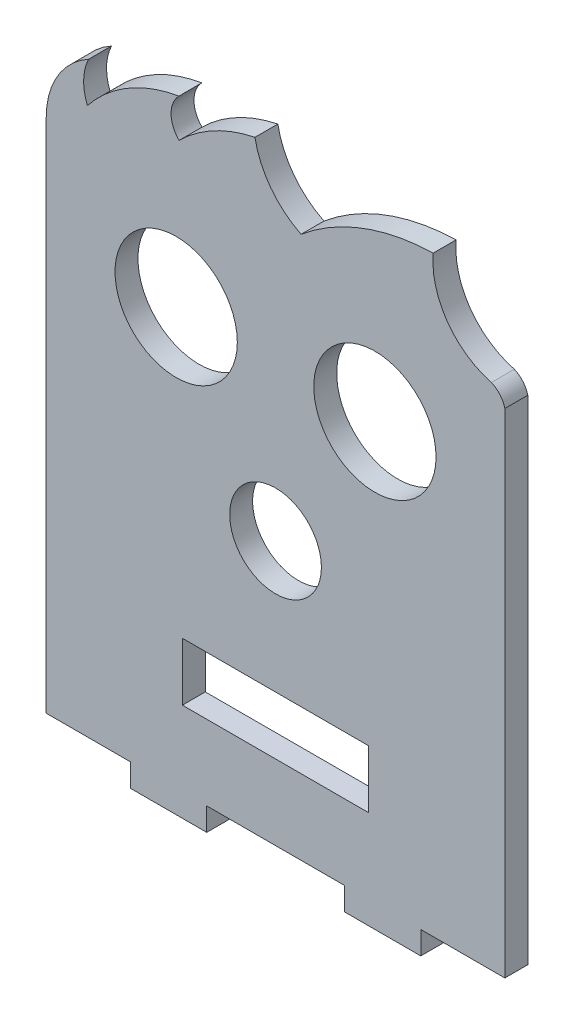
ISO-10303-21;
HEADER;
FILE_DESCRIPTION(('STEP AP214'),'2;1');
FILE_NAME('part.step','',(''),(''),'','','');
FILE_SCHEMA(('AUTOMOTIVE_DESIGN { 1 0 10303 214 1 1 1 1 }'));
ENDSEC;
DATA;
#1=APPLICATION_CONTEXT('core data for automotive mechanical design processes');
#2=APPLICATION_PROTOCOL_DEFINITION('international standard','automotive_design',2000,#1);
#3=PRODUCT_CONTEXT('',#1,'mechanical');
#4=PRODUCT('Part','Part','',(#3));
#5=PRODUCT_RELATED_PRODUCT_CATEGORY('part','',(#4));
#6=PRODUCT_DEFINITION_FORMATION('','',#4);
#7=PRODUCT_DEFINITION_CONTEXT('part definition',#1,'design');
#8=PRODUCT_DEFINITION('design','',#6,#7);
#9=PRODUCT_DEFINITION_SHAPE('','',#8);
#10=(LENGTH_UNIT() NAMED_UNIT(*) SI_UNIT(.MILLI.,.METRE.));
#11=(NAMED_UNIT(*) PLANE_ANGLE_UNIT() SI_UNIT($,.RADIAN.));
#12=(NAMED_UNIT(*) SI_UNIT($,.STERADIAN.) SOLID_ANGLE_UNIT());
#13=UNCERTAINTY_MEASURE_WITH_UNIT(LENGTH_MEASURE(1.E-05),#10,'distance_accuracy_value','');
#14=(GEOMETRIC_REPRESENTATION_CONTEXT(3) GLOBAL_UNCERTAINTY_ASSIGNED_CONTEXT((#13)) GLOBAL_UNIT_ASSIGNED_CONTEXT((#10,
#11,#12)) REPRESENTATION_CONTEXT('',''));
#15=CARTESIAN_POINT('',(0.,0.,0.));
#16=DIRECTION('',(0.,0.,1.));
#17=DIRECTION('',(1.,0.,0.));
#18=AXIS2_PLACEMENT_3D('',#15,#16,#17);
#19=CARTESIAN_POINT('',(57.0828060122341,63.8250898911995,3.));
#20=DIRECTION('',(0.,0.,1.));
#21=DIRECTION('',(1.,0.,0.));
#22=AXIS2_PLACEMENT_3D('',#19,#20,#21);
#23=PLANE('',#22);
#24=CARTESIAN_POINT('',(17.,54.5250750608487,3.));
#25=DIRECTION('',(0.,0.,1.));
#26=DIRECTION('',(1.,0.,0.));
#27=AXIS2_PLACEMENT_3D('',#24,#25,#26);
#28=CIRCLE('',#27,8.);
#29=CARTESIAN_POINT('',(25.,54.5250750608487,3.));
#30=VERTEX_POINT('',#29);
#31=EDGE_CURVE('E236',#30,#30,#28,.T.);
#32=ORIENTED_EDGE('',*,*,#31,.F.);
#33=EDGE_LOOP('',(#32));
#34=FACE_BOUND('',#33,.T.);
#35=CARTESIAN_POINT('',(57.0828060122341,63.8250898911995,3.));
#36=DIRECTION('',(0.,0.,1.));
#37=DIRECTION('',(1.,0.,0.));
#38=AXIS2_PLACEMENT_3D('',#35,#36,#37);
#39=CIRCLE('',#38,2.99999999995479);
#40=CARTESIAN_POINT('',(59.9999999999508,64.5250750608696,3.));
#41=VERTEX_POINT('',#40);
#42=CARTESIAN_POINT('',(58.2415675698039,66.5922674518969,3.));
#43=VERTEX_POINT('',#42);
#44=EDGE_CURVE('E248',#41,#43,#39,.T.);
#45=ORIENTED_EDGE('',*,*,#44,.T.);
#46=CARTESIAN_POINT('',(60.892074174128,76.5534327823503,3.));
#47=DIRECTION('',(0.,0.,-1.));
#48=DIRECTION('',(1.,0.,0.));
#49=AXIS2_PLACEMENT_3D('',#46,#47,#48);
#50=CIRCLE('',#49,10.3077640640535);
#51=CARTESIAN_POINT('',(50.622765109335,77.4429783584468,3.));
#52=VERTEX_POINT('',#51);
#53=EDGE_CURVE('E251',#43,#52,#50,.T.);
#54=ORIENTED_EDGE('',*,*,#53,.T.);
#55=CARTESIAN_POINT('',(51.2729090936527,49.5195795378246,3.));
#56=DIRECTION('',(0.,0.,1.));
#57=DIRECTION('',(1.,0.,0.));
#58=AXIS2_PLACEMENT_3D('',#55,#56,#57);
#59=CIRCLE('',#58,27.9309664869634);
#60=CARTESIAN_POINT('',(33.342205194527,70.9351987578646,3.));
#61=VERTEX_POINT('',#60);
#62=EDGE_CURVE('E254',#52,#61,#59,.T.);
#63=ORIENTED_EDGE('',*,*,#62,.T.);
#64=CARTESIAN_POINT('',(38.2960443073955,80.9581463304664,3.));
#65=DIRECTION('',(0.,0.,-1.));
#66=DIRECTION('',(1.,0.,0.));
#67=AXIS2_PLACEMENT_3D('',#64,#65,#66);
#68=CIRCLE('',#67,11.1803398874681);
#69=CARTESIAN_POINT('',(27.305382781595,78.907449077189,3.));
#70=VERTEX_POINT('',#69);
#71=EDGE_CURVE('E256',#61,#70,#68,.T.);
#72=ORIENTED_EDGE('',*,*,#71,.T.);
#73=CARTESIAN_POINT('',(31.2979275877632,59.5128255254766,3.));
#74=DIRECTION('',(0.,0.,1.));
#75=DIRECTION('',(1.,0.,0.));
#76=AXIS2_PLACEMENT_3D('',#73,#74,#75);
#77=CIRCLE('',#76,19.8013089653663);
#78=CARTESIAN_POINT('',(17.379828576101,73.5975107063199,3.));
#79=VERTEX_POINT('',#78);
#80=EDGE_CURVE('E258',#70,#79,#77,.T.);
#81=ORIENTED_EDGE('',*,*,#80,.T.);
#82=CARTESIAN_POINT('',(19.8682750672394,76.1090110668844,3.));
#83=DIRECTION('',(0.,0.,-1.));
#84=DIRECTION('',(1.,0.,0.));
#85=AXIS2_PLACEMENT_3D('',#82,#83,#84);
#86=CIRCLE('',#85,3.53553390598575);
#87=CARTESIAN_POINT('',(17.356774706675,78.5974575580229,3.));
#88=VERTEX_POINT('',#87);
#89=EDGE_CURVE('E260',#79,#88,#86,.T.);
#90=ORIENTED_EDGE('',*,*,#89,.T.);
#91=CARTESIAN_POINT('',(20.5448075358998,59.5119539838493,3.));
#92=DIRECTION('',(0.,0.,1.));
#93=DIRECTION('',(1.,0.,0.));
#94=AXIS2_PLACEMENT_3D('',#91,#92,#93);
#95=CIRCLE('',#94,19.3499354004093);
#96=CARTESIAN_POINT('',(5.38917767995182,71.5422026790969,3.));
#97=VERTEX_POINT('',#96);
#98=EDGE_CURVE('E262',#88,#97,#95,.T.);
#99=ORIENTED_EDGE('',*,*,#98,.T.);
#100=CARTESIAN_POINT('',(11.4111939225212,74.0392650279305,3.));
#101=DIRECTION('',(0.,0.,-1.));
#102=DIRECTION('',(1.,0.,0.));
#103=AXIS2_PLACEMENT_3D('',#100,#101,#102);
#104=CIRCLE('',#103,6.51920240518206);
#105=CARTESIAN_POINT('',(5.53620196702089,76.8649453924689,3.));
#106=VERTEX_POINT('',#105);
#107=EDGE_CURVE('E264',#97,#106,#104,.T.);
#108=ORIENTED_EDGE('',*,*,#107,.T.);
#109=CARTESIAN_POINT('',(10.6447043172942,67.5261588056378,3.));
#110=DIRECTION('',(0.,0.,1.));
#111=DIRECTION('',(1.,0.,0.));
#112=AXIS2_PLACEMENT_3D('',#109,#110,#111);
#113=CIRCLE('',#112,10.6447043724626);
#114=CARTESIAN_POINT('',(0.,67.5250750608487,3.));
#115=VERTEX_POINT('',#114);
#116=EDGE_CURVE('E266',#106,#115,#113,.T.);
#117=ORIENTED_EDGE('',*,*,#116,.T.);
#118=DIRECTION('',(0.,-1.,0.));
#119=VECTOR('',#118,1.);
#120=CARTESIAN_POINT('',(0.,67.5250750608487,3.));
#121=LINE('',#120,#119);
#122=CARTESIAN_POINT('',(0.,0.,3.));
#123=VERTEX_POINT('',#122);
#124=EDGE_CURVE('E268',#115,#123,#121,.T.);
#125=ORIENTED_EDGE('',*,*,#124,.T.);
#126=DIRECTION('',(1.,0.,0.));
#127=VECTOR('',#126,1.);
#128=CARTESIAN_POINT('',(0.,0.,3.));
#129=LINE('',#128,#127);
#130=CARTESIAN_POINT('',(11.,0.,3.));
#131=VERTEX_POINT('',#130);
#132=EDGE_CURVE('E270',#123,#131,#129,.T.);
#133=ORIENTED_EDGE('',*,*,#132,.T.);
#134=DIRECTION('',(0.,-1.,0.));
#135=VECTOR('',#134,1.);
#136=CARTESIAN_POINT('',(11.,0.,3.));
#137=LINE('',#136,#135);
#138=CARTESIAN_POINT('',(11.,-3.,3.));
#139=VERTEX_POINT('',#138);
#140=EDGE_CURVE('E272',#131,#139,#137,.T.);
#141=ORIENTED_EDGE('',*,*,#140,.T.);
#142=DIRECTION('',(1.,0.,0.));
#143=VECTOR('',#142,1.);
#144=CARTESIAN_POINT('',(11.,-3.,3.));
#145=LINE('',#144,#143);
#146=CARTESIAN_POINT('',(21.,-3.,3.));
#147=VERTEX_POINT('',#146);
#148=EDGE_CURVE('E274',#139,#147,#145,.T.);
#149=ORIENTED_EDGE('',*,*,#148,.T.);
#150=DIRECTION('',(0.,1.,0.));
#151=VECTOR('',#150,1.);
#152=CARTESIAN_POINT('',(21.,-3.,3.));
#153=LINE('',#152,#151);
#154=CARTESIAN_POINT('',(21.,0.,3.));
#155=VERTEX_POINT('',#154);
#156=EDGE_CURVE('E276',#147,#155,#153,.T.);
#157=ORIENTED_EDGE('',*,*,#156,.T.);
#158=DIRECTION('',(1.,0.,0.));
#159=VECTOR('',#158,1.);
#160=CARTESIAN_POINT('',(21.,0.,3.));
#161=LINE('',#160,#159);
#162=CARTESIAN_POINT('',(39.,0.,3.));
#163=VERTEX_POINT('',#162);
#164=EDGE_CURVE('E278',#155,#163,#161,.T.);
#165=ORIENTED_EDGE('',*,*,#164,.T.);
#166=DIRECTION('',(0.,-1.,0.));
#167=VECTOR('',#166,1.);
#168=CARTESIAN_POINT('',(39.,0.,3.));
#169=LINE('',#168,#167);
#170=CARTESIAN_POINT('',(39.,-3.,3.));
#171=VERTEX_POINT('',#170);
#172=EDGE_CURVE('E280',#163,#171,#169,.T.);
#173=ORIENTED_EDGE('',*,*,#172,.T.);
#174=DIRECTION('',(1.,0.,0.));
#175=VECTOR('',#174,1.);
#176=CARTESIAN_POINT('',(49.,-2.99999999999999,3.));
#177=LINE('',#176,#175);
#178=CARTESIAN_POINT('',(49.,-2.99999999999999,3.));
#179=VERTEX_POINT('',#178);
#180=EDGE_CURVE('E282',#171,#179,#177,.T.);
#181=ORIENTED_EDGE('',*,*,#180,.T.);
#182=DIRECTION('',(0.,1.,0.));
#183=VECTOR('',#182,1.);
#184=CARTESIAN_POINT('',(49.,-2.99999999999999,3.));
#185=LINE('',#184,#183);
#186=CARTESIAN_POINT('',(49.,0.,3.));
#187=VERTEX_POINT('',#186);
#188=EDGE_CURVE('E284',#179,#187,#185,.T.);
#189=ORIENTED_EDGE('',*,*,#188,.T.);
#190=DIRECTION('',(1.,0.,0.));
#191=VECTOR('',#190,1.);
#192=CARTESIAN_POINT('',(49.,0.,3.));
#193=LINE('',#192,#191);
#194=CARTESIAN_POINT('',(60.,0.,3.));
#195=VERTEX_POINT('',#194);
#196=EDGE_CURVE('E286',#187,#195,#193,.T.);
#197=ORIENTED_EDGE('',*,*,#196,.T.);
#198=DIRECTION('',(-7.61583718904839E-13,1.,0.));
#199=VECTOR('',#198,1.);
#200=CARTESIAN_POINT('',(60.,0.,3.));
#201=LINE('',#200,#199);
#202=EDGE_CURVE('E288',#195,#41,#201,.T.);
#203=ORIENTED_EDGE('',*,*,#202,.T.);
#204=EDGE_LOOP('',(#45,#54,#63,#72,#81,#90,#99,#108,#117,#125,#133,#141,#149,#157,#165,#173,
#181,#189,#197,#203));
#205=FACE_BOUND('',#204,.T.);
#206=CARTESIAN_POINT('',(43.,54.5250750608487,3.));
#207=DIRECTION('',(0.,0.,1.));
#208=DIRECTION('',(1.,0.,0.));
#209=AXIS2_PLACEMENT_3D('',#206,#207,#208);
#210=CIRCLE('',#209,8.);
#211=CARTESIAN_POINT('',(51.,54.5250750608487,3.));
#212=VERTEX_POINT('',#211);
#213=EDGE_CURVE('E242',#212,#212,#210,.T.);
#214=ORIENTED_EDGE('',*,*,#213,.F.);
#215=EDGE_LOOP('',(#214));
#216=FACE_BOUND('',#215,.T.);
#217=CARTESIAN_POINT('',(30.,34.5250750608487,3.));
#218=DIRECTION('',(0.,0.,1.));
#219=DIRECTION('',(1.,0.,0.));
#220=AXIS2_PLACEMENT_3D('',#217,#218,#219);
#221=CIRCLE('',#220,6.00000000000001);
#222=CARTESIAN_POINT('',(36.,34.5250750608487,3.));
#223=VERTEX_POINT('',#222);
#224=EDGE_CURVE('E230',#223,#223,#221,.T.);
#225=ORIENTED_EDGE('',*,*,#224,.F.);
#226=EDGE_LOOP('',(#225));
#227=FACE_BOUND('',#226,.T.);
#228=DIRECTION('',(0.,-1.,0.));
#229=VECTOR('',#228,1.);
#230=CARTESIAN_POINT('',(17.8099999999999,17.3990809937483,3.));
#231=LINE('',#230,#229);
#232=CARTESIAN_POINT('',(17.8099999999999,17.3990809937483,3.));
#233=VERTEX_POINT('',#232);
#234=CARTESIAN_POINT('',(17.8099999999999,9.81908099374828,3.));
#235=VERTEX_POINT('',#234);
#236=EDGE_CURVE('E202',#233,#235,#231,.T.);
#237=ORIENTED_EDGE('',*,*,#236,.F.);
#238=DIRECTION('',(-1.,0.,0.));
#239=VECTOR('',#238,1.);
#240=CARTESIAN_POINT('',(42.1899999999999,17.3990809937483,3.));
#241=LINE('',#240,#239);
#242=CARTESIAN_POINT('',(42.1899999999999,17.3990809937483,3.));
#243=VERTEX_POINT('',#242);
#244=EDGE_CURVE('E194',#243,#233,#241,.T.);
#245=ORIENTED_EDGE('',*,*,#244,.F.);
#246=DIRECTION('',(0.,1.,0.));
#247=VECTOR('',#246,1.);
#248=CARTESIAN_POINT('',(42.1899999999999,9.81908099374828,3.));
#249=LINE('',#248,#247);
#250=CARTESIAN_POINT('',(42.1899999999999,9.81908099374828,3.));
#251=VERTEX_POINT('',#250);
#252=EDGE_CURVE('E216',#251,#243,#249,.T.);
#253=ORIENTED_EDGE('',*,*,#252,.F.);
#254=DIRECTION('',(1.,0.,0.));
#255=VECTOR('',#254,1.);
#256=CARTESIAN_POINT('',(17.8099999999999,9.81908099374828,3.));
#257=LINE('',#256,#255);
#258=EDGE_CURVE('E214',#235,#251,#257,.T.);
#259=ORIENTED_EDGE('',*,*,#258,.F.);
#260=EDGE_LOOP('',(#237,#245,#253,#259));
#261=FACE_BOUND('',#260,.T.);
#262=ADVANCED_FACE('F33',(#34,#205,#216,#227,#261),#23,.T.);
#263=CARTESIAN_POINT('',(57.0828060122341,63.8250898911995,0.));
#264=DIRECTION('',(0.,0.,1.));
#265=DIRECTION('',(1.,0.,0.));
#266=AXIS2_PLACEMENT_3D('',#263,#264,#265);
#267=PLANE('',#266);
#268=CARTESIAN_POINT('',(30.,34.5250750608487,0.));
#269=DIRECTION('',(0.,0.,1.));
#270=DIRECTION('',(1.,0.,0.));
#271=AXIS2_PLACEMENT_3D('',#268,#269,#270);
#272=CIRCLE('',#271,6.00000000000001);
#273=CARTESIAN_POINT('',(36.,34.5250750608487,0.));
#274=VERTEX_POINT('',#273);
#275=EDGE_CURVE('E210',#274,#274,#272,.T.);
#276=ORIENTED_EDGE('',*,*,#275,.T.);
#277=EDGE_LOOP('',(#276));
#278=FACE_BOUND('',#277,.T.);
#279=CARTESIAN_POINT('',(17.,54.5250750608487,0.));
#280=DIRECTION('',(0.,0.,1.));
#281=DIRECTION('',(1.,0.,0.));
#282=AXIS2_PLACEMENT_3D('',#279,#280,#281);
#283=CIRCLE('',#282,8.);
#284=CARTESIAN_POINT('',(25.,54.5250750608487,0.));
#285=VERTEX_POINT('',#284);
#286=EDGE_CURVE('E233',#285,#285,#283,.T.);
#287=ORIENTED_EDGE('',*,*,#286,.T.);
#288=EDGE_LOOP('',(#287));
#289=FACE_BOUND('',#288,.T.);
#290=CARTESIAN_POINT('',(43.,54.5250750608487,0.));
#291=DIRECTION('',(0.,0.,1.));
#292=DIRECTION('',(1.,0.,0.));
#293=AXIS2_PLACEMENT_3D('',#290,#291,#292);
#294=CIRCLE('',#293,8.);
#295=CARTESIAN_POINT('',(51.,54.5250750608487,0.));
#296=VERTEX_POINT('',#295);
#297=EDGE_CURVE('E239',#296,#296,#294,.T.);
#298=ORIENTED_EDGE('',*,*,#297,.T.);
#299=EDGE_LOOP('',(#298));
#300=FACE_BOUND('',#299,.T.);
#301=CARTESIAN_POINT('',(57.0828060122341,63.8250898911995,0.));
#302=DIRECTION('',(0.,0.,1.));
#303=DIRECTION('',(1.,0.,0.));
#304=AXIS2_PLACEMENT_3D('',#301,#302,#303);
#305=CIRCLE('',#304,2.99999999995479);
#306=CARTESIAN_POINT('',(59.9999999999508,64.5250750608696,0.));
#307=VERTEX_POINT('',#306);
#308=CARTESIAN_POINT('',(58.2415675698039,66.5922674518969,0.));
#309=VERTEX_POINT('',#308);
#310=EDGE_CURVE('E245',#307,#309,#305,.T.);
#311=ORIENTED_EDGE('',*,*,#310,.F.);
#312=DIRECTION('',(-7.61583718904839E-13,1.,0.));
#313=VECTOR('',#312,1.);
#314=CARTESIAN_POINT('',(60.,0.,0.));
#315=LINE('',#314,#313);
#316=CARTESIAN_POINT('',(60.,0.,0.));
#317=VERTEX_POINT('',#316);
#318=EDGE_CURVE('E252',#317,#307,#315,.T.);
#319=ORIENTED_EDGE('',*,*,#318,.F.);
#320=DIRECTION('',(1.,0.,0.));
#321=VECTOR('',#320,1.);
#322=CARTESIAN_POINT('',(49.,0.,0.));
#323=LINE('',#322,#321);
#324=CARTESIAN_POINT('',(49.,0.,0.));
#325=VERTEX_POINT('',#324);
#326=EDGE_CURVE('E328',#325,#317,#323,.T.);
#327=ORIENTED_EDGE('',*,*,#326,.F.);
#328=DIRECTION('',(0.,1.,0.));
#329=VECTOR('',#328,1.);
#330=CARTESIAN_POINT('',(49.,-2.99999999999999,0.));
#331=LINE('',#330,#329);
#332=CARTESIAN_POINT('',(49.,-2.99999999999999,0.));
#333=VERTEX_POINT('',#332);
#334=EDGE_CURVE('E326',#333,#325,#331,.T.);
#335=ORIENTED_EDGE('',*,*,#334,.F.);
#336=DIRECTION('',(1.,0.,0.));
#337=VECTOR('',#336,1.);
#338=CARTESIAN_POINT('',(49.,-2.99999999999999,0.));
#339=LINE('',#338,#337);
#340=CARTESIAN_POINT('',(39.,-3.,0.));
#341=VERTEX_POINT('',#340);
#342=EDGE_CURVE('E324',#341,#333,#339,.T.);
#343=ORIENTED_EDGE('',*,*,#342,.F.);
#344=DIRECTION('',(0.,-1.,0.));
#345=VECTOR('',#344,1.);
#346=CARTESIAN_POINT('',(39.,0.,0.));
#347=LINE('',#346,#345);
#348=CARTESIAN_POINT('',(39.,0.,0.));
#349=VERTEX_POINT('',#348);
#350=EDGE_CURVE('E322',#349,#341,#347,.T.);
#351=ORIENTED_EDGE('',*,*,#350,.F.);
#352=DIRECTION('',(1.,0.,0.));
#353=VECTOR('',#352,1.);
#354=CARTESIAN_POINT('',(21.,0.,0.));
#355=LINE('',#354,#353);
#356=CARTESIAN_POINT('',(21.,0.,0.));
#357=VERTEX_POINT('',#356);
#358=EDGE_CURVE('E320',#357,#349,#355,.T.);
#359=ORIENTED_EDGE('',*,*,#358,.F.);
#360=DIRECTION('',(0.,1.,0.));
#361=VECTOR('',#360,1.);
#362=CARTESIAN_POINT('',(21.,-3.,0.));
#363=LINE('',#362,#361);
#364=CARTESIAN_POINT('',(21.,-3.,0.));
#365=VERTEX_POINT('',#364);
#366=EDGE_CURVE('E318',#365,#357,#363,.T.);
#367=ORIENTED_EDGE('',*,*,#366,.F.);
#368=DIRECTION('',(1.,0.,0.));
#369=VECTOR('',#368,1.);
#370=CARTESIAN_POINT('',(11.,-3.,0.));
#371=LINE('',#370,#369);
#372=CARTESIAN_POINT('',(11.,-3.,0.));
#373=VERTEX_POINT('',#372);
#374=EDGE_CURVE('E316',#373,#365,#371,.T.);
#375=ORIENTED_EDGE('',*,*,#374,.F.);
#376=DIRECTION('',(0.,-1.,0.));
#377=VECTOR('',#376,1.);
#378=CARTESIAN_POINT('',(11.,0.,0.));
#379=LINE('',#378,#377);
#380=CARTESIAN_POINT('',(11.,0.,0.));
#381=VERTEX_POINT('',#380);
#382=EDGE_CURVE('E314',#381,#373,#379,.T.);
#383=ORIENTED_EDGE('',*,*,#382,.F.);
#384=DIRECTION('',(1.,0.,0.));
#385=VECTOR('',#384,1.);
#386=CARTESIAN_POINT('',(0.,0.,0.));
#387=LINE('',#386,#385);
#388=CARTESIAN_POINT('',(0.,0.,0.));
#389=VERTEX_POINT('',#388);
#390=EDGE_CURVE('E312',#389,#381,#387,.T.);
#391=ORIENTED_EDGE('',*,*,#390,.F.);
#392=DIRECTION('',(0.,-1.,0.));
#393=VECTOR('',#392,1.);
#394=CARTESIAN_POINT('',(0.,11.5200977794683,0.));
#395=LINE('',#394,#393);
#396=CARTESIAN_POINT('',(0.,67.5250750608487,0.));
#397=VERTEX_POINT('',#396);
#398=EDGE_CURVE('E310',#397,#389,#395,.T.);
#399=ORIENTED_EDGE('',*,*,#398,.F.);
#400=CARTESIAN_POINT('',(10.6447043172942,67.5261588056378,0.));
#401=DIRECTION('',(0.,0.,1.));
#402=DIRECTION('',(1.,0.,0.));
#403=AXIS2_PLACEMENT_3D('',#400,#401,#402);
#404=CIRCLE('',#403,10.6447043724626);
#405=CARTESIAN_POINT('',(5.53620196702089,76.8649453924689,0.));
#406=VERTEX_POINT('',#405);
#407=EDGE_CURVE('E307',#406,#397,#404,.T.);
#408=ORIENTED_EDGE('',*,*,#407,.F.);
#409=CARTESIAN_POINT('',(11.4111939225212,74.0392650279305,0.));
#410=DIRECTION('',(0.,0.,-1.));
#411=DIRECTION('',(1.,0.,0.));
#412=AXIS2_PLACEMENT_3D('',#409,#410,#411);
#413=CIRCLE('',#412,6.51920240518206);
#414=CARTESIAN_POINT('',(5.38917767995182,71.5422026790969,0.));
#415=VERTEX_POINT('',#414);
#416=EDGE_CURVE('E305',#415,#406,#413,.T.);
#417=ORIENTED_EDGE('',*,*,#416,.F.);
#418=CARTESIAN_POINT('',(20.5448075358998,59.5119539838493,0.));
#419=DIRECTION('',(0.,0.,1.));
#420=DIRECTION('',(1.,0.,0.));
#421=AXIS2_PLACEMENT_3D('',#418,#419,#420);
#422=CIRCLE('',#421,19.3499354004093);
#423=CARTESIAN_POINT('',(17.356774706675,78.5974575580229,0.));
#424=VERTEX_POINT('',#423);
#425=EDGE_CURVE('E303',#424,#415,#422,.T.);
#426=ORIENTED_EDGE('',*,*,#425,.F.);
#427=CARTESIAN_POINT('',(19.8682750672394,76.1090110668844,0.));
#428=DIRECTION('',(0.,0.,-1.));
#429=DIRECTION('',(1.,0.,0.));
#430=AXIS2_PLACEMENT_3D('',#427,#428,#429);
#431=CIRCLE('',#430,3.53553390598575);
#432=CARTESIAN_POINT('',(17.379828576101,73.5975107063199,0.));
#433=VERTEX_POINT('',#432);
#434=EDGE_CURVE('E301',#433,#424,#431,.T.);
#435=ORIENTED_EDGE('',*,*,#434,.F.);
#436=CARTESIAN_POINT('',(31.2979275877632,59.5128255254766,0.));
#437=DIRECTION('',(0.,0.,1.));
#438=DIRECTION('',(1.,0.,0.));
#439=AXIS2_PLACEMENT_3D('',#436,#437,#438);
#440=CIRCLE('',#439,19.8013089653663);
#441=CARTESIAN_POINT('',(27.305382781595,78.907449077189,0.));
#442=VERTEX_POINT('',#441);
#443=EDGE_CURVE('E299',#442,#433,#440,.T.);
#444=ORIENTED_EDGE('',*,*,#443,.F.);
#445=CARTESIAN_POINT('',(38.2960443073955,80.9581463304664,0.));
#446=DIRECTION('',(0.,0.,-1.));
#447=DIRECTION('',(1.,0.,0.));
#448=AXIS2_PLACEMENT_3D('',#445,#446,#447);
#449=CIRCLE('',#448,11.1803398874681);
#450=CARTESIAN_POINT('',(33.342205194527,70.9351987578646,0.));
#451=VERTEX_POINT('',#450);
#452=EDGE_CURVE('E297',#451,#442,#449,.T.);
#453=ORIENTED_EDGE('',*,*,#452,.F.);
#454=CARTESIAN_POINT('',(51.2729090936527,49.5195795378246,0.));
#455=DIRECTION('',(0.,0.,1.));
#456=DIRECTION('',(1.,0.,0.));
#457=AXIS2_PLACEMENT_3D('',#454,#455,#456);
#458=CIRCLE('',#457,27.9309664869634);
#459=CARTESIAN_POINT('',(50.622765109335,77.4429783584468,0.));
#460=VERTEX_POINT('',#459);
#461=EDGE_CURVE('E295',#460,#451,#458,.T.);
#462=ORIENTED_EDGE('',*,*,#461,.F.);
#463=CARTESIAN_POINT('',(60.892074174128,76.5534327823503,0.));
#464=DIRECTION('',(0.,0.,-1.));
#465=DIRECTION('',(1.,0.,0.));
#466=AXIS2_PLACEMENT_3D('',#463,#464,#465);
#467=CIRCLE('',#466,10.3077640640535);
#468=EDGE_CURVE('E293',#309,#460,#467,.T.);
#469=ORIENTED_EDGE('',*,*,#468,.F.);
#470=EDGE_LOOP('',(#311,#319,#327,#335,#343,#351,#359,#367,#375,#383,#391,#399,#408,#417,#426,
#435,#444,#453,#462,#469));
#471=FACE_BOUND('',#470,.T.);
#472=DIRECTION('',(-1.,0.,0.));
#473=VECTOR('',#472,1.);
#474=CARTESIAN_POINT('',(42.1899999999999,17.3990809937483,0.));
#475=LINE('',#474,#473);
#476=CARTESIAN_POINT('',(42.1899999999999,17.3990809937483,0.));
#477=VERTEX_POINT('',#476);
#478=CARTESIAN_POINT('',(17.8099999999999,17.3990809937483,0.));
#479=VERTEX_POINT('',#478);
#480=EDGE_CURVE('E56',#477,#479,#475,.T.);
#481=ORIENTED_EDGE('',*,*,#480,.T.);
#482=DIRECTION('',(0.,-1.,0.));
#483=VECTOR('',#482,1.);
#484=CARTESIAN_POINT('',(17.8099999999999,17.3990809937483,0.));
#485=LINE('',#484,#483);
#486=CARTESIAN_POINT('',(17.8099999999999,9.81908099374828,0.));
#487=VERTEX_POINT('',#486);
#488=EDGE_CURVE('E209',#479,#487,#485,.T.);
#489=ORIENTED_EDGE('',*,*,#488,.T.);
#490=DIRECTION('',(1.,0.,0.));
#491=VECTOR('',#490,1.);
#492=CARTESIAN_POINT('',(17.8099999999999,9.81908099374828,0.));
#493=LINE('',#492,#491);
#494=CARTESIAN_POINT('',(42.1899999999999,9.81908099374828,0.));
#495=VERTEX_POINT('',#494);
#496=EDGE_CURVE('E222',#487,#495,#493,.T.);
#497=ORIENTED_EDGE('',*,*,#496,.T.);
#498=DIRECTION('',(0.,1.,0.));
#499=VECTOR('',#498,1.);
#500=CARTESIAN_POINT('',(42.1899999999999,9.81908099374828,0.));
#501=LINE('',#500,#499);
#502=EDGE_CURVE('E203',#495,#477,#501,.T.);
#503=ORIENTED_EDGE('',*,*,#502,.T.);
#504=EDGE_LOOP('',(#481,#489,#497,#503));
#505=FACE_BOUND('',#504,.T.);
#506=ADVANCED_FACE('F394',(#278,#289,#300,#471,#505),#267,.F.);
#507=CARTESIAN_POINT('',(57.0828060122341,63.8250898911995,3.));
#508=DIRECTION('',(0.,0.,-1.));
#509=DIRECTION('',(-1.,0.,0.));
#510=AXIS2_PLACEMENT_3D('',#507,#508,#509);
#511=CYLINDRICAL_SURFACE('',#510,2.99999999995479);
#512=ORIENTED_EDGE('',*,*,#310,.T.);
#513=DIRECTION('',(0.,0.,-1.));
#514=VECTOR('',#513,1.);
#515=CARTESIAN_POINT('',(58.2415675698039,66.5922674518969,3.));
#516=LINE('',#515,#514);
#517=EDGE_CURVE('E11',#43,#309,#516,.T.);
#518=ORIENTED_EDGE('',*,*,#517,.F.);
#519=ORIENTED_EDGE('',*,*,#44,.F.);
#520=DIRECTION('',(0.,0.,-1.));
#521=VECTOR('',#520,1.);
#522=CARTESIAN_POINT('',(59.9999999999508,64.5250750608696,3.));
#523=LINE('',#522,#521);
#524=EDGE_CURVE('E290',#41,#307,#523,.T.);
#525=ORIENTED_EDGE('',*,*,#524,.T.);
#526=EDGE_LOOP('',(#512,#518,#519,#525));
#527=FACE_BOUND('',#526,.T.);
#528=ADVANCED_FACE('F35',(#527),#511,.T.);
#529=CARTESIAN_POINT('',(60.892074174128,76.5534327823503,3.));
#530=DIRECTION('',(0.,0.,-1.));
#531=DIRECTION('',(-1.,0.,0.));
#532=AXIS2_PLACEMENT_3D('',#529,#530,#531);
#533=CYLINDRICAL_SURFACE('',#532,10.3077640640535);
#534=ORIENTED_EDGE('',*,*,#468,.T.);
#535=DIRECTION('',(0.,0.,-1.));
#536=VECTOR('',#535,1.);
#537=CARTESIAN_POINT('',(50.622765109335,77.4429783584468,3.));
#538=LINE('',#537,#536);
#539=EDGE_CURVE('E41',#52,#460,#538,.T.);
#540=ORIENTED_EDGE('',*,*,#539,.F.);
#541=ORIENTED_EDGE('',*,*,#53,.F.);
#542=ORIENTED_EDGE('',*,*,#517,.T.);
#543=EDGE_LOOP('',(#534,#540,#541,#542));
#544=FACE_BOUND('',#543,.T.);
#545=ADVANCED_FACE('F412',(#544),#533,.F.);
#546=CARTESIAN_POINT('',(51.2729090936527,49.5195795378246,3.));
#547=DIRECTION('',(0.,0.,-1.));
#548=DIRECTION('',(-1.,0.,0.));
#549=AXIS2_PLACEMENT_3D('',#546,#547,#548);
#550=CYLINDRICAL_SURFACE('',#549,27.9309664869634);
#551=ORIENTED_EDGE('',*,*,#461,.T.);
#552=DIRECTION('',(0.,0.,-1.));
#553=VECTOR('',#552,1.);
#554=CARTESIAN_POINT('',(33.342205194527,70.9351987578646,3.));
#555=LINE('',#554,#553);
#556=EDGE_CURVE('E381',#61,#451,#555,.T.);
#557=ORIENTED_EDGE('',*,*,#556,.F.);
#558=ORIENTED_EDGE('',*,*,#62,.F.);
#559=ORIENTED_EDGE('',*,*,#539,.T.);
#560=EDGE_LOOP('',(#551,#557,#558,#559));
#561=FACE_BOUND('',#560,.T.);
#562=ADVANCED_FACE('F388',(#561),#550,.T.);
#563=CARTESIAN_POINT('',(38.2960443073955,80.9581463304664,3.));
#564=DIRECTION('',(0.,0.,-1.));
#565=DIRECTION('',(-1.,0.,0.));
#566=AXIS2_PLACEMENT_3D('',#563,#564,#565);
#567=CYLINDRICAL_SURFACE('',#566,11.1803398874681);
#568=ORIENTED_EDGE('',*,*,#452,.T.);
#569=DIRECTION('',(0.,0.,-1.));
#570=VECTOR('',#569,1.);
#571=CARTESIAN_POINT('',(27.305382781595,78.907449077189,3.));
#572=LINE('',#571,#570);
#573=EDGE_CURVE('E378',#70,#442,#572,.T.);
#574=ORIENTED_EDGE('',*,*,#573,.F.);
#575=ORIENTED_EDGE('',*,*,#71,.F.);
#576=ORIENTED_EDGE('',*,*,#556,.T.);
#577=EDGE_LOOP('',(#568,#574,#575,#576));
#578=FACE_BOUND('',#577,.T.);
#579=ADVANCED_FACE('F400',(#578),#567,.F.);
#580=CARTESIAN_POINT('',(31.2979275877632,59.5128255254766,3.));
#581=DIRECTION('',(0.,0.,-1.));
#582=DIRECTION('',(-1.,0.,0.));
#583=AXIS2_PLACEMENT_3D('',#580,#581,#582);
#584=CYLINDRICAL_SURFACE('',#583,19.8013089653663);
#585=ORIENTED_EDGE('',*,*,#443,.T.);
#586=DIRECTION('',(0.,0.,-1.));
#587=VECTOR('',#586,1.);
#588=CARTESIAN_POINT('',(17.379828576101,73.5975107063199,3.));
#589=LINE('',#588,#587);
#590=EDGE_CURVE('E375',#79,#433,#589,.T.);
#591=ORIENTED_EDGE('',*,*,#590,.F.);
#592=ORIENTED_EDGE('',*,*,#80,.F.);
#593=ORIENTED_EDGE('',*,*,#573,.T.);
#594=EDGE_LOOP('',(#585,#591,#592,#593));
#595=FACE_BOUND('',#594,.T.);
#596=ADVANCED_FACE('F404',(#595),#584,.T.);
#597=CARTESIAN_POINT('',(19.8682750672394,76.1090110668844,3.));
#598=DIRECTION('',(0.,0.,-1.));
#599=DIRECTION('',(-1.,0.,0.));
#600=AXIS2_PLACEMENT_3D('',#597,#598,#599);
#601=CYLINDRICAL_SURFACE('',#600,3.53553390598575);
#602=ORIENTED_EDGE('',*,*,#434,.T.);
#603=DIRECTION('',(0.,0.,-1.));
#604=VECTOR('',#603,1.);
#605=CARTESIAN_POINT('',(17.356774706675,78.5974575580229,3.));
#606=LINE('',#605,#604);
#607=EDGE_CURVE('E372',#88,#424,#606,.T.);
#608=ORIENTED_EDGE('',*,*,#607,.F.);
#609=ORIENTED_EDGE('',*,*,#89,.F.);
#610=ORIENTED_EDGE('',*,*,#590,.T.);
#611=EDGE_LOOP('',(#602,#608,#609,#610));
#612=FACE_BOUND('',#611,.T.);
#613=ADVANCED_FACE('F484',(#612),#601,.F.);
#614=CARTESIAN_POINT('',(20.5448075358998,59.5119539838493,3.));
#615=DIRECTION('',(0.,0.,-1.));
#616=DIRECTION('',(-1.,0.,0.));
#617=AXIS2_PLACEMENT_3D('',#614,#615,#616);
#618=CYLINDRICAL_SURFACE('',#617,19.3499354004093);
#619=ORIENTED_EDGE('',*,*,#425,.T.);
#620=DIRECTION('',(0.,0.,-1.));
#621=VECTOR('',#620,1.);
#622=CARTESIAN_POINT('',(5.38917767995182,71.5422026790969,3.));
#623=LINE('',#622,#621);
#624=EDGE_CURVE('E369',#97,#415,#623,.T.);
#625=ORIENTED_EDGE('',*,*,#624,.F.);
#626=ORIENTED_EDGE('',*,*,#98,.F.);
#627=ORIENTED_EDGE('',*,*,#607,.T.);
#628=EDGE_LOOP('',(#619,#625,#626,#627));
#629=FACE_BOUND('',#628,.T.);
#630=ADVANCED_FACE('F482',(#629),#618,.T.);
#631=CARTESIAN_POINT('',(11.4111939225212,74.0392650279305,3.));
#632=DIRECTION('',(0.,0.,-1.));
#633=DIRECTION('',(-1.,0.,0.));
#634=AXIS2_PLACEMENT_3D('',#631,#632,#633);
#635=CYLINDRICAL_SURFACE('',#634,6.51920240518206);
#636=ORIENTED_EDGE('',*,*,#416,.T.);
#637=DIRECTION('',(0.,0.,-1.));
#638=VECTOR('',#637,1.);
#639=CARTESIAN_POINT('',(5.53620196702089,76.8649453924689,3.));
#640=LINE('',#639,#638);
#641=EDGE_CURVE('E366',#106,#406,#640,.T.);
#642=ORIENTED_EDGE('',*,*,#641,.F.);
#643=ORIENTED_EDGE('',*,*,#107,.F.);
#644=ORIENTED_EDGE('',*,*,#624,.T.);
#645=EDGE_LOOP('',(#636,#642,#643,#644));
#646=FACE_BOUND('',#645,.T.);
#647=ADVANCED_FACE('F477',(#646),#635,.F.);
#648=CARTESIAN_POINT('',(10.6447043172942,67.5261588056378,3.));
#649=DIRECTION('',(0.,0.,-1.));
#650=DIRECTION('',(-1.,0.,0.));
#651=AXIS2_PLACEMENT_3D('',#648,#649,#650);
#652=CYLINDRICAL_SURFACE('',#651,10.6447043724626);
#653=ORIENTED_EDGE('',*,*,#407,.T.);
#654=DIRECTION('',(0.,0.,-1.));
#655=VECTOR('',#654,1.);
#656=CARTESIAN_POINT('',(0.,67.5250750608487,3.));
#657=LINE('',#656,#655);
#658=EDGE_CURVE('E363',#115,#397,#657,.T.);
#659=ORIENTED_EDGE('',*,*,#658,.F.);
#660=ORIENTED_EDGE('',*,*,#116,.F.);
#661=ORIENTED_EDGE('',*,*,#641,.T.);
#662=EDGE_LOOP('',(#653,#659,#660,#661));
#663=FACE_BOUND('',#662,.T.);
#664=ADVANCED_FACE('F472',(#663),#652,.T.);
#665=CARTESIAN_POINT('',(0.,11.5200977794683,3.));
#666=DIRECTION('',(1.,0.,0.));
#667=DIRECTION('',(0.,0.,-1.));
#668=AXIS2_PLACEMENT_3D('',#665,#666,#667);
#669=PLANE('',#668);
#670=ORIENTED_EDGE('',*,*,#398,.T.);
#671=DIRECTION('',(0.,0.,-1.));
#672=VECTOR('',#671,1.);
#673=CARTESIAN_POINT('',(0.,0.,3.));
#674=LINE('',#673,#672);
#675=EDGE_CURVE('E360',#123,#389,#674,.T.);
#676=ORIENTED_EDGE('',*,*,#675,.F.);
#677=ORIENTED_EDGE('',*,*,#124,.F.);
#678=ORIENTED_EDGE('',*,*,#658,.T.);
#679=EDGE_LOOP('',(#670,#676,#677,#678));
#680=FACE_BOUND('',#679,.T.);
#681=ADVANCED_FACE('F468',(#680),#669,.F.);
#682=CARTESIAN_POINT('',(0.,0.,3.));
#683=DIRECTION('',(0.,1.,0.));
#684=DIRECTION('',(0.,0.,1.));
#685=AXIS2_PLACEMENT_3D('',#682,#683,#684);
#686=PLANE('',#685);
#687=ORIENTED_EDGE('',*,*,#390,.T.);
#688=DIRECTION('',(0.,0.,-1.));
#689=VECTOR('',#688,1.);
#690=CARTESIAN_POINT('',(11.,0.,3.));
#691=LINE('',#690,#689);
#692=EDGE_CURVE('E357',#131,#381,#691,.T.);
#693=ORIENTED_EDGE('',*,*,#692,.F.);
#694=ORIENTED_EDGE('',*,*,#132,.F.);
#695=ORIENTED_EDGE('',*,*,#675,.T.);
#696=EDGE_LOOP('',(#687,#693,#694,#695));
#697=FACE_BOUND('',#696,.T.);
#698=ADVANCED_FACE('F463',(#697),#686,.F.);
#699=CARTESIAN_POINT('',(11.,0.,3.));
#700=DIRECTION('',(1.,0.,0.));
#701=DIRECTION('',(0.,0.,-1.));
#702=AXIS2_PLACEMENT_3D('',#699,#700,#701);
#703=PLANE('',#702);
#704=ORIENTED_EDGE('',*,*,#382,.T.);
#705=DIRECTION('',(0.,0.,-1.));
#706=VECTOR('',#705,1.);
#707=CARTESIAN_POINT('',(11.,-3.,3.));
#708=LINE('',#707,#706);
#709=EDGE_CURVE('E354',#139,#373,#708,.T.);
#710=ORIENTED_EDGE('',*,*,#709,.F.);
#711=ORIENTED_EDGE('',*,*,#140,.F.);
#712=ORIENTED_EDGE('',*,*,#692,.T.);
#713=EDGE_LOOP('',(#704,#710,#711,#712));
#714=FACE_BOUND('',#713,.T.);
#715=ADVANCED_FACE('F458',(#714),#703,.F.);
#716=CARTESIAN_POINT('',(11.,-3.,3.));
#717=DIRECTION('',(0.,1.,0.));
#718=DIRECTION('',(0.,0.,1.));
#719=AXIS2_PLACEMENT_3D('',#716,#717,#718);
#720=PLANE('',#719);
#721=ORIENTED_EDGE('',*,*,#374,.T.);
#722=DIRECTION('',(0.,0.,-1.));
#723=VECTOR('',#722,1.);
#724=CARTESIAN_POINT('',(21.,-3.,3.));
#725=LINE('',#724,#723);
#726=EDGE_CURVE('E351',#147,#365,#725,.T.);
#727=ORIENTED_EDGE('',*,*,#726,.F.);
#728=ORIENTED_EDGE('',*,*,#148,.F.);
#729=ORIENTED_EDGE('',*,*,#709,.T.);
#730=EDGE_LOOP('',(#721,#727,#728,#729));
#731=FACE_BOUND('',#730,.T.);
#732=ADVANCED_FACE('F454',(#731),#720,.F.);
#733=CARTESIAN_POINT('',(21.,-3.,3.));
#734=DIRECTION('',(-1.,0.,0.));
#735=DIRECTION('',(0.,0.,1.));
#736=AXIS2_PLACEMENT_3D('',#733,#734,#735);
#737=PLANE('',#736);
#738=ORIENTED_EDGE('',*,*,#366,.T.);
#739=DIRECTION('',(0.,0.,-1.));
#740=VECTOR('',#739,1.);
#741=CARTESIAN_POINT('',(21.,0.,3.));
#742=LINE('',#741,#740);
#743=EDGE_CURVE('E348',#155,#357,#742,.T.);
#744=ORIENTED_EDGE('',*,*,#743,.F.);
#745=ORIENTED_EDGE('',*,*,#156,.F.);
#746=ORIENTED_EDGE('',*,*,#726,.T.);
#747=EDGE_LOOP('',(#738,#744,#745,#746));
#748=FACE_BOUND('',#747,.T.);
#749=ADVANCED_FACE('F449',(#748),#737,.F.);
#750=CARTESIAN_POINT('',(21.,0.,3.));
#751=DIRECTION('',(0.,1.,0.));
#752=DIRECTION('',(0.,0.,1.));
#753=AXIS2_PLACEMENT_3D('',#750,#751,#752);
#754=PLANE('',#753);
#755=ORIENTED_EDGE('',*,*,#358,.T.);
#756=DIRECTION('',(0.,0.,-1.));
#757=VECTOR('',#756,1.);
#758=CARTESIAN_POINT('',(39.,0.,3.));
#759=LINE('',#758,#757);
#760=EDGE_CURVE('E345',#163,#349,#759,.T.);
#761=ORIENTED_EDGE('',*,*,#760,.F.);
#762=ORIENTED_EDGE('',*,*,#164,.F.);
#763=ORIENTED_EDGE('',*,*,#743,.T.);
#764=EDGE_LOOP('',(#755,#761,#762,#763));
#765=FACE_BOUND('',#764,.T.);
#766=ADVANCED_FACE('F443',(#765),#754,.F.);
#767=CARTESIAN_POINT('',(39.,0.,3.));
#768=DIRECTION('',(1.,0.,0.));
#769=DIRECTION('',(0.,0.,-1.));
#770=AXIS2_PLACEMENT_3D('',#767,#768,#769);
#771=PLANE('',#770);
#772=ORIENTED_EDGE('',*,*,#350,.T.);
#773=DIRECTION('',(0.,0.,-1.));
#774=VECTOR('',#773,1.);
#775=CARTESIAN_POINT('',(39.,-3.,3.));
#776=LINE('',#775,#774);
#777=EDGE_CURVE('E342',#171,#341,#776,.T.);
#778=ORIENTED_EDGE('',*,*,#777,.F.);
#779=ORIENTED_EDGE('',*,*,#172,.F.);
#780=ORIENTED_EDGE('',*,*,#760,.T.);
#781=EDGE_LOOP('',(#772,#778,#779,#780));
#782=FACE_BOUND('',#781,.T.);
#783=ADVANCED_FACE('F439',(#782),#771,.F.);
#784=CARTESIAN_POINT('',(49.,-2.99999999999999,3.));
#785=DIRECTION('',(0.,1.,0.));
#786=DIRECTION('',(-1.,0.,0.));
#787=AXIS2_PLACEMENT_3D('',#784,#785,#786);
#788=PLANE('',#787);
#789=ORIENTED_EDGE('',*,*,#342,.T.);
#790=DIRECTION('',(0.,0.,-1.));
#791=VECTOR('',#790,1.);
#792=CARTESIAN_POINT('',(49.,-2.99999999999999,3.));
#793=LINE('',#792,#791);
#794=EDGE_CURVE('E339',#179,#333,#793,.T.);
#795=ORIENTED_EDGE('',*,*,#794,.F.);
#796=ORIENTED_EDGE('',*,*,#180,.F.);
#797=ORIENTED_EDGE('',*,*,#777,.T.);
#798=EDGE_LOOP('',(#789,#795,#796,#797));
#799=FACE_BOUND('',#798,.T.);
#800=ADVANCED_FACE('F434',(#799),#788,.F.);
#801=CARTESIAN_POINT('',(49.,-2.99999999999999,3.));
#802=DIRECTION('',(-1.,0.,0.));
#803=DIRECTION('',(0.,0.,1.));
#804=AXIS2_PLACEMENT_3D('',#801,#802,#803);
#805=PLANE('',#804);
#806=ORIENTED_EDGE('',*,*,#334,.T.);
#807=DIRECTION('',(0.,0.,-1.));
#808=VECTOR('',#807,1.);
#809=CARTESIAN_POINT('',(49.,0.,3.));
#810=LINE('',#809,#808);
#811=EDGE_CURVE('E336',#187,#325,#810,.T.);
#812=ORIENTED_EDGE('',*,*,#811,.F.);
#813=ORIENTED_EDGE('',*,*,#188,.F.);
#814=ORIENTED_EDGE('',*,*,#794,.T.);
#815=EDGE_LOOP('',(#806,#812,#813,#814));
#816=FACE_BOUND('',#815,.T.);
#817=ADVANCED_FACE('F428',(#816),#805,.F.);
#818=CARTESIAN_POINT('',(49.,0.,3.));
#819=DIRECTION('',(0.,1.,0.));
#820=DIRECTION('',(0.,0.,1.));
#821=AXIS2_PLACEMENT_3D('',#818,#819,#820);
#822=PLANE('',#821);
#823=ORIENTED_EDGE('',*,*,#326,.T.);
#824=DIRECTION('',(0.,0.,-1.));
#825=VECTOR('',#824,1.);
#826=CARTESIAN_POINT('',(60.,0.,3.));
#827=LINE('',#826,#825);
#828=EDGE_CURVE('E333',#195,#317,#827,.T.);
#829=ORIENTED_EDGE('',*,*,#828,.F.);
#830=ORIENTED_EDGE('',*,*,#196,.F.);
#831=ORIENTED_EDGE('',*,*,#811,.T.);
#832=EDGE_LOOP('',(#823,#829,#830,#831));
#833=FACE_BOUND('',#832,.T.);
#834=ADVANCED_FACE('F424',(#833),#822,.F.);
#835=CARTESIAN_POINT('',(60.,0.,3.));
#836=DIRECTION('',(-1.,-7.61583718904839E-13,0.));
#837=DIRECTION('',(7.61583718904839E-13,-1.,0.));
#838=AXIS2_PLACEMENT_3D('',#835,#836,#837);
#839=PLANE('',#838);
#840=ORIENTED_EDGE('',*,*,#318,.T.);
#841=ORIENTED_EDGE('',*,*,#524,.F.);
#842=ORIENTED_EDGE('',*,*,#202,.F.);
#843=ORIENTED_EDGE('',*,*,#828,.T.);
#844=EDGE_LOOP('',(#840,#841,#842,#843));
#845=FACE_BOUND('',#844,.T.);
#846=ADVANCED_FACE('F419',(#845),#839,.F.);
#847=CARTESIAN_POINT('',(43.,54.5250750608487,3.));
#848=DIRECTION('',(0.,0.,-1.));
#849=DIRECTION('',(-1.,0.,0.));
#850=AXIS2_PLACEMENT_3D('',#847,#848,#849);
#851=CYLINDRICAL_SURFACE('',#850,8.);
#852=ORIENTED_EDGE('',*,*,#213,.T.);
#853=EDGE_LOOP('',(#852));
#854=FACE_BOUND('',#853,.T.);
#855=ORIENTED_EDGE('',*,*,#297,.F.);
#856=EDGE_LOOP('',(#855));
#857=FACE_BOUND('',#856,.T.);
#858=ADVANCED_FACE('F503',(#854,#857),#851,.F.);
#859=CARTESIAN_POINT('',(17.,54.5250750608487,3.));
#860=DIRECTION('',(0.,0.,-1.));
#861=DIRECTION('',(-1.,0.,0.));
#862=AXIS2_PLACEMENT_3D('',#859,#860,#861);
#863=CYLINDRICAL_SURFACE('',#862,8.);
#864=ORIENTED_EDGE('',*,*,#31,.T.);
#865=EDGE_LOOP('',(#864));
#866=FACE_BOUND('',#865,.T.);
#867=ORIENTED_EDGE('',*,*,#286,.F.);
#868=EDGE_LOOP('',(#867));
#869=FACE_BOUND('',#868,.T.);
#870=ADVANCED_FACE('F589',(#866,#869),#863,.F.);
#871=CARTESIAN_POINT('',(30.,34.5250750608487,3.));
#872=DIRECTION('',(0.,0.,-1.));
#873=DIRECTION('',(-1.,0.,0.));
#874=AXIS2_PLACEMENT_3D('',#871,#872,#873);
#875=CYLINDRICAL_SURFACE('',#874,6.00000000000001);
#876=ORIENTED_EDGE('',*,*,#224,.T.);
#877=EDGE_LOOP('',(#876));
#878=FACE_BOUND('',#877,.T.);
#879=ORIENTED_EDGE('',*,*,#275,.F.);
#880=EDGE_LOOP('',(#879));
#881=FACE_BOUND('',#880,.T.);
#882=ADVANCED_FACE('F596',(#878,#881),#875,.F.);
#883=CARTESIAN_POINT('',(42.1899999999999,17.3990809937483,3.));
#884=DIRECTION('',(0.,-1.,0.));
#885=DIRECTION('',(1.,0.,0.));
#886=AXIS2_PLACEMENT_3D('',#883,#884,#885);
#887=PLANE('',#886);
#888=ORIENTED_EDGE('',*,*,#480,.F.);
#889=DIRECTION('',(0.,0.,-1.));
#890=VECTOR('',#889,1.);
#891=CARTESIAN_POINT('',(42.1899999999999,17.3990809937483,3.));
#892=LINE('',#891,#890);
#893=EDGE_CURVE('E198',#243,#477,#892,.T.);
#894=ORIENTED_EDGE('',*,*,#893,.F.);
#895=ORIENTED_EDGE('',*,*,#244,.T.);
#896=DIRECTION('',(0.,0.,-1.));
#897=VECTOR('',#896,1.);
#898=CARTESIAN_POINT('',(17.8099999999999,17.3990809937483,3.));
#899=LINE('',#898,#897);
#900=EDGE_CURVE('E197',#233,#479,#899,.T.);
#901=ORIENTED_EDGE('',*,*,#900,.T.);
#902=EDGE_LOOP('',(#888,#894,#895,#901));
#903=FACE_BOUND('',#902,.T.);
#904=ADVANCED_FACE('F196',(#903),#887,.T.);
#905=CARTESIAN_POINT('',(17.8099999999999,17.3990809937483,3.));
#906=DIRECTION('',(1.,0.,0.));
#907=DIRECTION('',(0.,0.,-1.));
#908=AXIS2_PLACEMENT_3D('',#905,#906,#907);
#909=PLANE('',#908);
#910=ORIENTED_EDGE('',*,*,#488,.F.);
#911=ORIENTED_EDGE('',*,*,#900,.F.);
#912=ORIENTED_EDGE('',*,*,#236,.T.);
#913=DIRECTION('',(0.,0.,-1.));
#914=VECTOR('',#913,1.);
#915=CARTESIAN_POINT('',(17.8099999999999,9.81908099374828,3.));
#916=LINE('',#915,#914);
#917=EDGE_CURVE('E211',#235,#487,#916,.T.);
#918=ORIENTED_EDGE('',*,*,#917,.T.);
#919=EDGE_LOOP('',(#910,#911,#912,#918));
#920=FACE_BOUND('',#919,.T.);
#921=ADVANCED_FACE('F206',(#920),#909,.T.);
#922=CARTESIAN_POINT('',(17.8099999999999,9.81908099374828,3.));
#923=DIRECTION('',(0.,1.,0.));
#924=DIRECTION('',(0.,0.,1.));
#925=AXIS2_PLACEMENT_3D('',#922,#923,#924);
#926=PLANE('',#925);
#927=ORIENTED_EDGE('',*,*,#496,.F.);
#928=ORIENTED_EDGE('',*,*,#917,.F.);
#929=ORIENTED_EDGE('',*,*,#258,.T.);
#930=DIRECTION('',(0.,0.,-1.));
#931=VECTOR('',#930,1.);
#932=CARTESIAN_POINT('',(42.1899999999999,9.81908099374828,3.));
#933=LINE('',#932,#931);
#934=EDGE_CURVE('E48',#251,#495,#933,.T.);
#935=ORIENTED_EDGE('',*,*,#934,.T.);
#936=EDGE_LOOP('',(#927,#928,#929,#935));
#937=FACE_BOUND('',#936,.T.);
#938=ADVANCED_FACE('F616',(#937),#926,.T.);
#939=CARTESIAN_POINT('',(42.1899999999999,9.81908099374828,3.));
#940=DIRECTION('',(-1.,0.,0.));
#941=DIRECTION('',(0.,0.,1.));
#942=AXIS2_PLACEMENT_3D('',#939,#940,#941);
#943=PLANE('',#942);
#944=ORIENTED_EDGE('',*,*,#502,.F.);
#945=ORIENTED_EDGE('',*,*,#934,.F.);
#946=ORIENTED_EDGE('',*,*,#252,.T.);
#947=ORIENTED_EDGE('',*,*,#893,.T.);
#948=EDGE_LOOP('',(#944,#945,#946,#947));
#949=FACE_BOUND('',#948,.T.);
#950=ADVANCED_FACE('F623',(#949),#943,.T.);
#951=CLOSED_SHELL('',(#262,#506,#528,#545,#562,#579,#596,#613,#630,#647,#664,#681,#698,#715,
#732,#749,#766,#783,#800,#817,#834,#846,#858,#870,#882,#904,#921,#938,#950));
#952=MANIFOLD_SOLID_BREP('B2',#951);
#953=ADVANCED_BREP_SHAPE_REPRESENTATION('',(#18,#952),#14);
#954=SHAPE_DEFINITION_REPRESENTATION(#9,#953);
ENDSEC;
END-ISO-10303-21;
